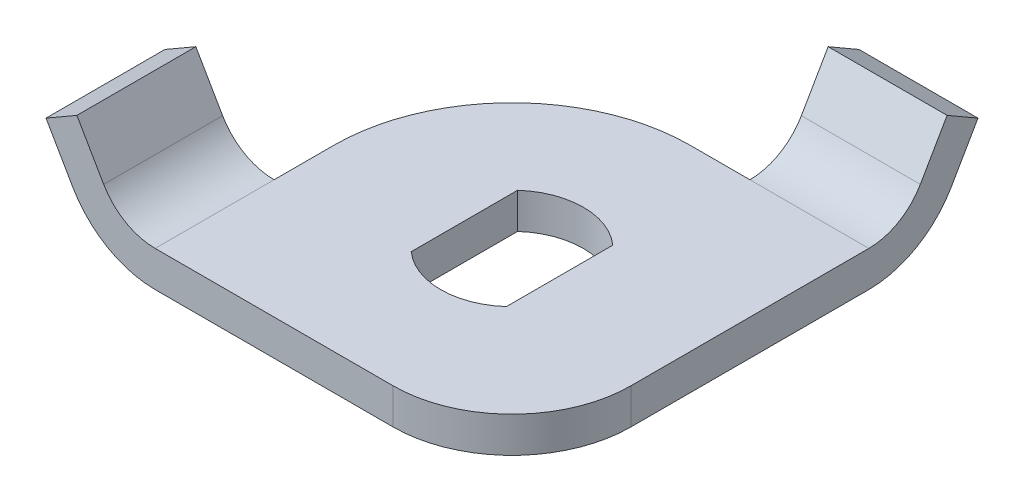
ISO-10303-21;
HEADER;
FILE_DESCRIPTION(('STEP AP214'),'2;1');
FILE_NAME('part.step','',(''),(''),'','','');
FILE_SCHEMA(('AUTOMOTIVE_DESIGN { 1 0 10303 214 1 1 1 1 }'));
ENDSEC;
DATA;
#1=APPLICATION_CONTEXT('core data for automotive mechanical design processes');
#2=APPLICATION_PROTOCOL_DEFINITION('international standard','automotive_design',2000,#1);
#3=PRODUCT_CONTEXT('',#1,'mechanical');
#4=PRODUCT('Part','Part','',(#3));
#5=PRODUCT_RELATED_PRODUCT_CATEGORY('part','',(#4));
#6=PRODUCT_DEFINITION_FORMATION('','',#4);
#7=PRODUCT_DEFINITION_CONTEXT('part definition',#1,'design');
#8=PRODUCT_DEFINITION('design','',#6,#7);
#9=PRODUCT_DEFINITION_SHAPE('','',#8);
#10=(LENGTH_UNIT() NAMED_UNIT(*) SI_UNIT(.MILLI.,.METRE.));
#11=(NAMED_UNIT(*) PLANE_ANGLE_UNIT() SI_UNIT($,.RADIAN.));
#12=(NAMED_UNIT(*) SI_UNIT($,.STERADIAN.) SOLID_ANGLE_UNIT());
#13=UNCERTAINTY_MEASURE_WITH_UNIT(LENGTH_MEASURE(1.E-05),#10,'distance_accuracy_value','');
#14=(GEOMETRIC_REPRESENTATION_CONTEXT(3) GLOBAL_UNCERTAINTY_ASSIGNED_CONTEXT((#13)) GLOBAL_UNIT_ASSIGNED_CONTEXT((#10,
#11,#12)) REPRESENTATION_CONTEXT('',''));
#15=CARTESIAN_POINT('',(0.,0.,0.));
#16=DIRECTION('',(0.,0.,1.));
#17=DIRECTION('',(1.,0.,0.));
#18=AXIS2_PLACEMENT_3D('',#15,#16,#17);
#19=CARTESIAN_POINT('',(-15.,3.,-15.));
#20=DIRECTION('',(0.,0.,1.));
#21=DIRECTION('',(1.,0.,0.));
#22=AXIS2_PLACEMENT_3D('',#19,#20,#21);
#23=PLANE('',#22);
#24=DIRECTION('',(0.,-1.,0.));
#25=VECTOR('',#24,1.);
#26=CARTESIAN_POINT('',(4.99999999999999,3.,-15.));
#27=LINE('',#26,#25);
#28=CARTESIAN_POINT('',(4.99999999999999,3.,-15.));
#29=VERTEX_POINT('',#28);
#30=CARTESIAN_POINT('',(4.99999999999999,0.,-15.));
#31=VERTEX_POINT('',#30);
#32=EDGE_CURVE('E204',#29,#31,#27,.T.);
#33=ORIENTED_EDGE('',*,*,#32,.T.);
#34=DIRECTION('',(-1.,0.,0.));
#35=VECTOR('',#34,1.);
#36=CARTESIAN_POINT('',(-15.,0.,-15.));
#37=LINE('',#36,#35);
#38=CARTESIAN_POINT('',(0.,0.,-15.));
#39=VERTEX_POINT('',#38);
#40=EDGE_CURVE('E294',#31,#39,#37,.T.);
#41=ORIENTED_EDGE('',*,*,#40,.T.);
#42=DIRECTION('',(0.,-1.,0.));
#43=VECTOR('',#42,1.);
#44=CARTESIAN_POINT('',(0.,3.,-15.));
#45=LINE('',#44,#43);
#46=CARTESIAN_POINT('',(0.,3.,-15.));
#47=VERTEX_POINT('',#46);
#48=EDGE_CURVE('E307',#39,#47,#45,.F.);
#49=ORIENTED_EDGE('',*,*,#48,.T.);
#50=DIRECTION('',(-1.,0.,0.));
#51=VECTOR('',#50,1.);
#52=CARTESIAN_POINT('',(-15.,3.,-15.));
#53=LINE('',#52,#51);
#54=EDGE_CURVE('E364',#29,#47,#53,.T.);
#55=ORIENTED_EDGE('',*,*,#54,.F.);
#56=EDGE_LOOP('',(#33,#41,#49,#55));
#57=FACE_BOUND('',#56,.T.);
#58=ADVANCED_FACE('F33',(#57),#23,.F.);
#59=CARTESIAN_POINT('',(-15.,3.,15.));
#60=DIRECTION('',(1.,0.,0.));
#61=DIRECTION('',(0.,0.,-1.));
#62=AXIS2_PLACEMENT_3D('',#59,#60,#61);
#63=PLANE('',#62);
#64=DIRECTION('',(0.,0.,1.));
#65=VECTOR('',#64,1.);
#66=CARTESIAN_POINT('',(-15.,3.,15.));
#67=LINE('',#66,#65);
#68=CARTESIAN_POINT('',(-15.,3.,0.));
#69=VERTEX_POINT('',#68);
#70=CARTESIAN_POINT('',(-15.,3.,5.));
#71=VERTEX_POINT('',#70);
#72=EDGE_CURVE('E278',#69,#71,#67,.T.);
#73=ORIENTED_EDGE('',*,*,#72,.F.);
#74=DIRECTION('',(0.,-1.,0.));
#75=VECTOR('',#74,1.);
#76=CARTESIAN_POINT('',(-15.,3.,0.));
#77=LINE('',#76,#75);
#78=CARTESIAN_POINT('',(-15.,0.,0.));
#79=VERTEX_POINT('',#78);
#80=EDGE_CURVE('E291',#69,#79,#77,.T.);
#81=ORIENTED_EDGE('',*,*,#80,.T.);
#82=DIRECTION('',(0.,0.,1.));
#83=VECTOR('',#82,1.);
#84=CARTESIAN_POINT('',(-15.,0.,15.));
#85=LINE('',#84,#83);
#86=CARTESIAN_POINT('',(-15.,0.,5.));
#87=VERTEX_POINT('',#86);
#88=EDGE_CURVE('E283',#79,#87,#85,.T.);
#89=ORIENTED_EDGE('',*,*,#88,.T.);
#90=DIRECTION('',(0.,-1.,0.));
#91=VECTOR('',#90,1.);
#92=CARTESIAN_POINT('',(-15.,0.,5.));
#93=LINE('',#92,#91);
#94=EDGE_CURVE('E252',#71,#87,#93,.T.);
#95=ORIENTED_EDGE('',*,*,#94,.F.);
#96=EDGE_LOOP('',(#73,#81,#89,#95));
#97=FACE_BOUND('',#96,.T.);
#98=ADVANCED_FACE('F407',(#97),#63,.F.);
#99=CARTESIAN_POINT('',(15.,3.,15.));
#100=DIRECTION('',(-1.,0.,0.));
#101=DIRECTION('',(0.,0.,1.));
#102=AXIS2_PLACEMENT_3D('',#99,#100,#101);
#103=PLANE('',#102);
#104=DIRECTION('',(0.,0.,-1.));
#105=VECTOR('',#104,1.);
#106=CARTESIAN_POINT('',(15.,3.,15.));
#107=LINE('',#106,#105);
#108=CARTESIAN_POINT('',(15.,3.,5.));
#109=VERTEX_POINT('',#108);
#110=CARTESIAN_POINT('',(15.,3.,-15.));
#111=VERTEX_POINT('',#110);
#112=EDGE_CURVE('E344',#109,#111,#107,.T.);
#113=ORIENTED_EDGE('',*,*,#112,.F.);
#114=DIRECTION('',(0.,-1.,0.));
#115=VECTOR('',#114,1.);
#116=CARTESIAN_POINT('',(15.,3.,5.));
#117=LINE('',#116,#115);
#118=CARTESIAN_POINT('',(15.,0.,5.));
#119=VERTEX_POINT('',#118);
#120=EDGE_CURVE('E321',#109,#119,#117,.T.);
#121=ORIENTED_EDGE('',*,*,#120,.T.);
#122=DIRECTION('',(0.,0.,-1.));
#123=VECTOR('',#122,1.);
#124=CARTESIAN_POINT('',(15.,0.,15.));
#125=LINE('',#124,#123);
#126=CARTESIAN_POINT('',(15.,0.,-15.));
#127=VERTEX_POINT('',#126);
#128=EDGE_CURVE('E292',#119,#127,#125,.T.);
#129=ORIENTED_EDGE('',*,*,#128,.T.);
#130=CARTESIAN_POINT('',(15.,8.,-15.));
#131=DIRECTION('',(1.,0.,0.));
#132=DIRECTION('',(0.,0.,-1.));
#133=AXIS2_PLACEMENT_3D('',#130,#131,#132);
#134=CIRCLE('',#133,8.);
#135=CARTESIAN_POINT('',(15.,3.99999999999997,-21.9282032302755));
#136=VERTEX_POINT('',#135);
#137=EDGE_CURVE('E223',#127,#136,#134,.T.);
#138=ORIENTED_EDGE('',*,*,#137,.T.);
#139=DIRECTION('',(0.,0.866025403784437,-0.500000000000003));
#140=VECTOR('',#139,1.);
#141=CARTESIAN_POINT('',(15.,7.89711431702993,-24.1782032302755));
#142=LINE('',#141,#140);
#143=CARTESIAN_POINT('',(15.,7.89711431702993,-24.1782032302755));
#144=VERTEX_POINT('',#143);
#145=EDGE_CURVE('E226',#136,#144,#142,.T.);
#146=ORIENTED_EDGE('',*,*,#145,.T.);
#147=DIRECTION('',(0.,0.500000000000004,0.866025403784436));
#148=VECTOR('',#147,1.);
#149=CARTESIAN_POINT('',(15.,9.39711431702994,-21.5801270189222));
#150=LINE('',#149,#148);
#151=CARTESIAN_POINT('',(15.,9.39711431702994,-21.5801270189222));
#152=VERTEX_POINT('',#151);
#153=EDGE_CURVE('E229',#144,#152,#150,.T.);
#154=ORIENTED_EDGE('',*,*,#153,.T.);
#155=DIRECTION('',(0.,-0.866025403784436,0.500000000000004));
#156=VECTOR('',#155,1.);
#157=CARTESIAN_POINT('',(15.,5.49999999999998,-19.3301270189222));
#158=LINE('',#157,#156);
#159=CARTESIAN_POINT('',(15.,5.49999999999998,-19.3301270189222));
#160=VERTEX_POINT('',#159);
#161=EDGE_CURVE('E205',#152,#160,#158,.T.);
#162=ORIENTED_EDGE('',*,*,#161,.T.);
#163=CARTESIAN_POINT('',(15.,8.,-15.));
#164=DIRECTION('',(-1.,0.,0.));
#165=DIRECTION('',(0.,0.,-1.));
#166=AXIS2_PLACEMENT_3D('',#163,#164,#165);
#167=CIRCLE('',#166,5.);
#168=EDGE_CURVE('E199',#160,#111,#167,.T.);
#169=ORIENTED_EDGE('',*,*,#168,.T.);
#170=EDGE_LOOP('',(#113,#121,#129,#138,#146,#154,#162,#169));
#171=FACE_BOUND('',#170,.T.);
#172=ADVANCED_FACE('F343',(#171),#103,.F.);
#173=CARTESIAN_POINT('',(-15.,3.,15.));
#174=DIRECTION('',(0.,0.,-1.));
#175=DIRECTION('',(-1.,0.,0.));
#176=AXIS2_PLACEMENT_3D('',#173,#174,#175);
#177=PLANE('',#176);
#178=DIRECTION('',(1.,0.,0.));
#179=VECTOR('',#178,1.);
#180=CARTESIAN_POINT('',(-15.,0.,15.));
#181=LINE('',#180,#179);
#182=CARTESIAN_POINT('',(-15.,0.,15.));
#183=VERTEX_POINT('',#182);
#184=CARTESIAN_POINT('',(4.99999999999999,0.,15.));
#185=VERTEX_POINT('',#184);
#186=EDGE_CURVE('E257',#183,#185,#181,.T.);
#187=ORIENTED_EDGE('',*,*,#186,.T.);
#188=DIRECTION('',(0.,-1.,0.));
#189=VECTOR('',#188,1.);
#190=CARTESIAN_POINT('',(4.99999999999999,3.,15.));
#191=LINE('',#190,#189);
#192=CARTESIAN_POINT('',(4.99999999999999,3.,15.));
#193=VERTEX_POINT('',#192);
#194=EDGE_CURVE('E41',#185,#193,#191,.F.);
#195=ORIENTED_EDGE('',*,*,#194,.T.);
#196=DIRECTION('',(1.,0.,0.));
#197=VECTOR('',#196,1.);
#198=CARTESIAN_POINT('',(-15.,3.,15.));
#199=LINE('',#198,#197);
#200=CARTESIAN_POINT('',(-15.,3.,15.));
#201=VERTEX_POINT('',#200);
#202=EDGE_CURVE('E281',#201,#193,#199,.T.);
#203=ORIENTED_EDGE('',*,*,#202,.F.);
#204=CARTESIAN_POINT('',(-15.,8.,15.));
#205=DIRECTION('',(0.,0.,1.));
#206=DIRECTION('',(1.,0.,0.));
#207=AXIS2_PLACEMENT_3D('',#204,#205,#206);
#208=CIRCLE('',#207,5.);
#209=CARTESIAN_POINT('',(-19.3301270189222,5.50000000000001,15.));
#210=VERTEX_POINT('',#209);
#211=EDGE_CURVE('E377',#210,#201,#208,.T.);
#212=ORIENTED_EDGE('',*,*,#211,.F.);
#213=DIRECTION('',(0.499999999999999,-0.866025403784439,0.));
#214=VECTOR('',#213,1.);
#215=CARTESIAN_POINT('',(-12.1160254037845,-6.99519052838328,15.));
#216=LINE('',#215,#214);
#217=CARTESIAN_POINT('',(-21.5801270189222,9.39711431702999,15.));
#218=VERTEX_POINT('',#217);
#219=EDGE_CURVE('E375',#218,#210,#216,.T.);
#220=ORIENTED_EDGE('',*,*,#219,.F.);
#221=DIRECTION('',(0.86602540378444,0.499999999999997,0.));
#222=VECTOR('',#221,1.);
#223=CARTESIAN_POINT('',(-9.46410161513769,16.3923048454133,15.));
#224=LINE('',#223,#222);
#225=CARTESIAN_POINT('',(-24.1782032302755,7.89711431703,15.));
#226=VERTEX_POINT('',#225);
#227=EDGE_CURVE('E246',#226,#218,#224,.T.);
#228=ORIENTED_EDGE('',*,*,#227,.F.);
#229=DIRECTION('',(0.499999999999998,-0.86602540378444,0.));
#230=VECTOR('',#229,1.);
#231=CARTESIAN_POINT('',(-14.7141016151378,-8.49519052838328,15.));
#232=LINE('',#231,#230);
#233=CARTESIAN_POINT('',(-21.9282032302755,4.00000000000002,15.));
#234=VERTEX_POINT('',#233);
#235=EDGE_CURVE('E236',#226,#234,#232,.T.);
#236=ORIENTED_EDGE('',*,*,#235,.T.);
#237=CARTESIAN_POINT('',(-15.,8.,15.));
#238=DIRECTION('',(0.,0.,1.));
#239=DIRECTION('',(1.,0.,0.));
#240=AXIS2_PLACEMENT_3D('',#237,#238,#239);
#241=CIRCLE('',#240,8.);
#242=EDGE_CURVE('E379',#234,#183,#241,.T.);
#243=ORIENTED_EDGE('',*,*,#242,.T.);
#244=EDGE_LOOP('',(#187,#195,#203,#212,#220,#228,#236,#243));
#245=FACE_BOUND('',#244,.T.);
#246=ADVANCED_FACE('F331',(#245),#177,.F.);
#247=CARTESIAN_POINT('',(0.,3.,0.));
#248=DIRECTION('',(0.,-1.,0.));
#249=DIRECTION('',(0.,0.,-1.));
#250=AXIS2_PLACEMENT_3D('',#247,#248,#249);
#251=PLANE('',#250);
#252=DIRECTION('',(0.,0.,1.));
#253=VECTOR('',#252,1.);
#254=CARTESIAN_POINT('',(-4.,3.,-4.47213595499958));
#255=LINE('',#254,#253);
#256=CARTESIAN_POINT('',(-4.,3.,-4.47213595499958));
#257=VERTEX_POINT('',#256);
#258=CARTESIAN_POINT('',(-4.,3.,4.47213595499958));
#259=VERTEX_POINT('',#258);
#260=EDGE_CURVE('E605',#257,#259,#255,.T.);
#261=ORIENTED_EDGE('',*,*,#260,.F.);
#262=CARTESIAN_POINT('',(0.,3.,0.));
#263=DIRECTION('',(0.,-1.,0.));
#264=DIRECTION('',(0.,0.,-1.));
#265=AXIS2_PLACEMENT_3D('',#262,#263,#264);
#266=CIRCLE('',#265,6.);
#267=CARTESIAN_POINT('',(4.,3.,-4.47213595499958));
#268=VERTEX_POINT('',#267);
#269=EDGE_CURVE('E200',#268,#257,#266,.F.);
#270=ORIENTED_EDGE('',*,*,#269,.F.);
#271=DIRECTION('',(0.,0.,-1.));
#272=VECTOR('',#271,1.);
#273=CARTESIAN_POINT('',(4.,3.,4.47213595499958));
#274=LINE('',#273,#272);
#275=CARTESIAN_POINT('',(4.,3.,4.47213595499958));
#276=VERTEX_POINT('',#275);
#277=EDGE_CURVE('E197',#276,#268,#274,.T.);
#278=ORIENTED_EDGE('',*,*,#277,.F.);
#279=CARTESIAN_POINT('',(0.,3.,0.));
#280=DIRECTION('',(0.,-1.,0.));
#281=DIRECTION('',(0.,0.,-1.));
#282=AXIS2_PLACEMENT_3D('',#279,#280,#281);
#283=CIRCLE('',#282,6.);
#284=EDGE_CURVE('E175',#259,#276,#283,.F.);
#285=ORIENTED_EDGE('',*,*,#284,.F.);
#286=EDGE_LOOP('',(#261,#270,#278,#285));
#287=FACE_BOUND('',#286,.T.);
#288=ORIENTED_EDGE('',*,*,#202,.T.);
#289=CARTESIAN_POINT('',(4.99999999999999,3.,5.));
#290=DIRECTION('',(0.,-1.,0.));
#291=DIRECTION('',(0.,0.,-1.));
#292=AXIS2_PLACEMENT_3D('',#289,#290,#291);
#293=CIRCLE('',#292,10.);
#294=EDGE_CURVE('E11',#193,#109,#293,.F.);
#295=ORIENTED_EDGE('',*,*,#294,.T.);
#296=ORIENTED_EDGE('',*,*,#112,.T.);
#297=EDGE_CURVE('E282',#111,#29,#53,.T.);
#298=ORIENTED_EDGE('',*,*,#297,.T.);
#299=ORIENTED_EDGE('',*,*,#54,.T.);
#300=CARTESIAN_POINT('',(0.,3.,0.));
#301=DIRECTION('',(0.,-1.,0.));
#302=DIRECTION('',(0.,0.,-1.));
#303=AXIS2_PLACEMENT_3D('',#300,#301,#302);
#304=CIRCLE('',#303,15.);
#305=EDGE_CURVE('E319',#47,#69,#304,.F.);
#306=ORIENTED_EDGE('',*,*,#305,.T.);
#307=ORIENTED_EDGE('',*,*,#72,.T.);
#308=DIRECTION('',(0.,0.,1.));
#309=VECTOR('',#308,1.);
#310=CARTESIAN_POINT('',(-15.,3.,5.));
#311=LINE('',#310,#309);
#312=EDGE_CURVE('E262',#71,#201,#311,.T.);
#313=ORIENTED_EDGE('',*,*,#312,.T.);
#314=EDGE_LOOP('',(#288,#295,#296,#298,#299,#306,#307,#313));
#315=FACE_BOUND('',#314,.T.);
#316=ADVANCED_FACE('F338',(#287,#315),#251,.F.);
#317=CARTESIAN_POINT('',(0.,0.,0.));
#318=DIRECTION('',(0.,-1.,0.));
#319=DIRECTION('',(0.,0.,-1.));
#320=AXIS2_PLACEMENT_3D('',#317,#318,#319);
#321=PLANE('',#320);
#322=CARTESIAN_POINT('',(0.,0.,0.));
#323=DIRECTION('',(0.,-1.,0.));
#324=DIRECTION('',(0.,0.,-1.));
#325=AXIS2_PLACEMENT_3D('',#322,#323,#324);
#326=CIRCLE('',#325,6.);
#327=CARTESIAN_POINT('',(-4.,0.,-4.47213595499958));
#328=VERTEX_POINT('',#327);
#329=CARTESIAN_POINT('',(4.,0.,-4.47213595499958));
#330=VERTEX_POINT('',#329);
#331=EDGE_CURVE('E56',#328,#330,#326,.T.);
#332=ORIENTED_EDGE('',*,*,#331,.F.);
#333=DIRECTION('',(0.,0.,-1.));
#334=VECTOR('',#333,1.);
#335=CARTESIAN_POINT('',(-4.,0.,-4.47213595499958));
#336=LINE('',#335,#334);
#337=CARTESIAN_POINT('',(-4.,0.,4.47213595499958));
#338=VERTEX_POINT('',#337);
#339=EDGE_CURVE('E188',#338,#328,#336,.T.);
#340=ORIENTED_EDGE('',*,*,#339,.F.);
#341=CARTESIAN_POINT('',(0.,0.,0.));
#342=DIRECTION('',(0.,-1.,0.));
#343=DIRECTION('',(0.,0.,-1.));
#344=AXIS2_PLACEMENT_3D('',#341,#342,#343);
#345=CIRCLE('',#344,6.);
#346=CARTESIAN_POINT('',(4.,0.,4.47213595499958));
#347=VERTEX_POINT('',#346);
#348=EDGE_CURVE('E172',#347,#338,#345,.T.);
#349=ORIENTED_EDGE('',*,*,#348,.F.);
#350=DIRECTION('',(0.,0.,1.));
#351=VECTOR('',#350,1.);
#352=CARTESIAN_POINT('',(4.,0.,4.47213595499958));
#353=LINE('',#352,#351);
#354=EDGE_CURVE('E181',#330,#347,#353,.T.);
#355=ORIENTED_EDGE('',*,*,#354,.F.);
#356=EDGE_LOOP('',(#332,#340,#349,#355));
#357=FACE_BOUND('',#356,.T.);
#358=ORIENTED_EDGE('',*,*,#128,.F.);
#359=CARTESIAN_POINT('',(4.99999999999999,0.,5.));
#360=DIRECTION('',(0.,-1.,0.));
#361=DIRECTION('',(0.,0.,-1.));
#362=AXIS2_PLACEMENT_3D('',#359,#360,#361);
#363=CIRCLE('',#362,10.);
#364=EDGE_CURVE('E326',#119,#185,#363,.T.);
#365=ORIENTED_EDGE('',*,*,#364,.T.);
#366=ORIENTED_EDGE('',*,*,#186,.F.);
#367=DIRECTION('',(0.,0.,1.));
#368=VECTOR('',#367,1.);
#369=CARTESIAN_POINT('',(-15.,0.,5.));
#370=LINE('',#369,#368);
#371=EDGE_CURVE('E259',#87,#183,#370,.T.);
#372=ORIENTED_EDGE('',*,*,#371,.F.);
#373=ORIENTED_EDGE('',*,*,#88,.F.);
#374=CARTESIAN_POINT('',(0.,0.,0.));
#375=DIRECTION('',(0.,-1.,0.));
#376=DIRECTION('',(0.,0.,-1.));
#377=AXIS2_PLACEMENT_3D('',#374,#375,#376);
#378=CIRCLE('',#377,15.);
#379=EDGE_CURVE('E311',#79,#39,#378,.T.);
#380=ORIENTED_EDGE('',*,*,#379,.T.);
#381=ORIENTED_EDGE('',*,*,#40,.F.);
#382=EDGE_CURVE('E296',#127,#31,#37,.T.);
#383=ORIENTED_EDGE('',*,*,#382,.F.);
#384=EDGE_LOOP('',(#358,#365,#366,#372,#373,#380,#381,#383));
#385=FACE_BOUND('',#384,.T.);
#386=ADVANCED_FACE('F185',(#357,#385),#321,.T.);
#387=CARTESIAN_POINT('',(-14.7141016151378,-8.49519052838328,5.));
#388=DIRECTION('',(-0.86602540378444,-0.499999999999998,0.));
#389=DIRECTION('',(0.499999999999998,-0.86602540378444,0.));
#390=AXIS2_PLACEMENT_3D('',#387,#388,#389);
#391=PLANE('',#390);
#392=ORIENTED_EDGE('',*,*,#235,.F.);
#393=DIRECTION('',(0.,0.,1.));
#394=VECTOR('',#393,1.);
#395=CARTESIAN_POINT('',(-24.1782032302755,7.89711431703,5.));
#396=LINE('',#395,#394);
#397=CARTESIAN_POINT('',(-24.1782032302755,7.89711431703,5.));
#398=VERTEX_POINT('',#397);
#399=EDGE_CURVE('E295',#398,#226,#396,.T.);
#400=ORIENTED_EDGE('',*,*,#399,.F.);
#401=DIRECTION('',(0.499999999999998,-0.86602540378444,0.));
#402=VECTOR('',#401,1.);
#403=CARTESIAN_POINT('',(-14.7141016151378,-8.49519052838328,5.));
#404=LINE('',#403,#402);
#405=CARTESIAN_POINT('',(-21.9282032302755,4.00000000000002,5.));
#406=VERTEX_POINT('',#405);
#407=EDGE_CURVE('E242',#398,#406,#404,.T.);
#408=ORIENTED_EDGE('',*,*,#407,.T.);
#409=DIRECTION('',(0.,0.,1.));
#410=VECTOR('',#409,1.);
#411=CARTESIAN_POINT('',(-21.9282032302755,4.00000000000002,5.));
#412=LINE('',#411,#410);
#413=EDGE_CURVE('E263',#406,#234,#412,.T.);
#414=ORIENTED_EDGE('',*,*,#413,.T.);
#415=EDGE_LOOP('',(#392,#400,#408,#414));
#416=FACE_BOUND('',#415,.T.);
#417=ADVANCED_FACE('F399',(#416),#391,.T.);
#418=CARTESIAN_POINT('',(-9.46410161513769,16.3923048454133,5.));
#419=DIRECTION('',(0.499999999999997,-0.86602540378444,0.));
#420=DIRECTION('',(0.86602540378444,0.499999999999998,0.));
#421=AXIS2_PLACEMENT_3D('',#418,#419,#420);
#422=PLANE('',#421);
#423=ORIENTED_EDGE('',*,*,#227,.T.);
#424=DIRECTION('',(0.,0.,1.));
#425=VECTOR('',#424,1.);
#426=CARTESIAN_POINT('',(-21.5801270189222,9.39711431702999,5.));
#427=LINE('',#426,#425);
#428=CARTESIAN_POINT('',(-21.5801270189222,9.39711431702999,5.));
#429=VERTEX_POINT('',#428);
#430=EDGE_CURVE('E370',#429,#218,#427,.T.);
#431=ORIENTED_EDGE('',*,*,#430,.F.);
#432=DIRECTION('',(0.86602540378444,0.499999999999997,0.));
#433=VECTOR('',#432,1.);
#434=CARTESIAN_POINT('',(-9.46410161513769,16.3923048454133,5.));
#435=LINE('',#434,#433);
#436=EDGE_CURVE('E367',#398,#429,#435,.T.);
#437=ORIENTED_EDGE('',*,*,#436,.F.);
#438=ORIENTED_EDGE('',*,*,#399,.T.);
#439=EDGE_LOOP('',(#423,#431,#437,#438));
#440=FACE_BOUND('',#439,.T.);
#441=ADVANCED_FACE('F431',(#440),#422,.F.);
#442=CARTESIAN_POINT('',(-12.1160254037845,-6.99519052838328,5.));
#443=DIRECTION('',(-0.866025403784439,-0.499999999999999,0.));
#444=DIRECTION('',(0.499999999999999,-0.866025403784439,0.));
#445=AXIS2_PLACEMENT_3D('',#442,#443,#444);
#446=PLANE('',#445);
#447=ORIENTED_EDGE('',*,*,#219,.T.);
#448=DIRECTION('',(0.,0.,1.));
#449=VECTOR('',#448,1.);
#450=CARTESIAN_POINT('',(-19.3301270189222,5.50000000000001,5.));
#451=LINE('',#450,#449);
#452=CARTESIAN_POINT('',(-19.3301270189222,5.50000000000001,5.));
#453=VERTEX_POINT('',#452);
#454=EDGE_CURVE('E275',#453,#210,#451,.T.);
#455=ORIENTED_EDGE('',*,*,#454,.F.);
#456=DIRECTION('',(0.499999999999999,-0.866025403784439,0.));
#457=VECTOR('',#456,1.);
#458=CARTESIAN_POINT('',(-12.1160254037845,-6.99519052838328,5.));
#459=LINE('',#458,#457);
#460=EDGE_CURVE('E249',#429,#453,#459,.T.);
#461=ORIENTED_EDGE('',*,*,#460,.F.);
#462=ORIENTED_EDGE('',*,*,#430,.T.);
#463=EDGE_LOOP('',(#447,#455,#461,#462));
#464=FACE_BOUND('',#463,.T.);
#465=ADVANCED_FACE('F391',(#464),#446,.F.);
#466=CARTESIAN_POINT('',(-15.,8.,5.));
#467=DIRECTION('',(0.,0.,1.));
#468=DIRECTION('',(1.,0.,0.));
#469=AXIS2_PLACEMENT_3D('',#466,#467,#468);
#470=CYLINDRICAL_SURFACE('',#469,5.);
#471=ORIENTED_EDGE('',*,*,#211,.T.);
#472=ORIENTED_EDGE('',*,*,#312,.F.);
#473=CARTESIAN_POINT('',(-15.,8.,5.));
#474=DIRECTION('',(0.,0.,1.));
#475=DIRECTION('',(1.,0.,0.));
#476=AXIS2_PLACEMENT_3D('',#473,#474,#475);
#477=CIRCLE('',#476,5.);
#478=EDGE_CURVE('E256',#453,#71,#477,.T.);
#479=ORIENTED_EDGE('',*,*,#478,.F.);
#480=ORIENTED_EDGE('',*,*,#454,.T.);
#481=EDGE_LOOP('',(#471,#472,#479,#480));
#482=FACE_BOUND('',#481,.T.);
#483=ADVANCED_FACE('F394',(#482),#470,.F.);
#484=CARTESIAN_POINT('',(-15.,8.,5.));
#485=DIRECTION('',(0.,0.,1.));
#486=DIRECTION('',(1.,0.,0.));
#487=AXIS2_PLACEMENT_3D('',#484,#485,#486);
#488=CYLINDRICAL_SURFACE('',#487,8.);
#489=ORIENTED_EDGE('',*,*,#242,.F.);
#490=ORIENTED_EDGE('',*,*,#413,.F.);
#491=CARTESIAN_POINT('',(-15.,8.,5.));
#492=DIRECTION('',(0.,0.,1.));
#493=DIRECTION('',(1.,0.,0.));
#494=AXIS2_PLACEMENT_3D('',#491,#492,#493);
#495=CIRCLE('',#494,8.);
#496=EDGE_CURVE('E245',#406,#87,#495,.T.);
#497=ORIENTED_EDGE('',*,*,#496,.T.);
#498=ORIENTED_EDGE('',*,*,#371,.T.);
#499=EDGE_LOOP('',(#489,#490,#497,#498));
#500=FACE_BOUND('',#499,.T.);
#501=ADVANCED_FACE('F403',(#500),#488,.T.);
#502=CARTESIAN_POINT('',(0.,0.,5.));
#503=DIRECTION('',(0.,0.,1.));
#504=DIRECTION('',(1.,0.,0.));
#505=AXIS2_PLACEMENT_3D('',#502,#503,#504);
#506=PLANE('',#505);
#507=ORIENTED_EDGE('',*,*,#407,.F.);
#508=ORIENTED_EDGE('',*,*,#436,.T.);
#509=ORIENTED_EDGE('',*,*,#460,.T.);
#510=ORIENTED_EDGE('',*,*,#478,.T.);
#511=ORIENTED_EDGE('',*,*,#94,.T.);
#512=ORIENTED_EDGE('',*,*,#496,.F.);
#513=EDGE_LOOP('',(#507,#508,#509,#510,#511,#512));
#514=FACE_BOUND('',#513,.T.);
#515=ADVANCED_FACE('F388',(#514),#506,.F.);
#516=CARTESIAN_POINT('',(0.,3.,0.));
#517=DIRECTION('',(0.,-1.,0.));
#518=DIRECTION('',(0.,0.,-1.));
#519=AXIS2_PLACEMENT_3D('',#516,#517,#518);
#520=CYLINDRICAL_SURFACE('',#519,15.);
#521=ORIENTED_EDGE('',*,*,#305,.F.);
#522=ORIENTED_EDGE('',*,*,#48,.F.);
#523=ORIENTED_EDGE('',*,*,#379,.F.);
#524=ORIENTED_EDGE('',*,*,#80,.F.);
#525=EDGE_LOOP('',(#521,#522,#523,#524));
#526=FACE_BOUND('',#525,.T.);
#527=ADVANCED_FACE('F318',(#526),#520,.T.);
#528=CARTESIAN_POINT('',(4.99999999999999,3.,5.));
#529=DIRECTION('',(0.,-1.,0.));
#530=DIRECTION('',(0.,0.,-1.));
#531=AXIS2_PLACEMENT_3D('',#528,#529,#530);
#532=CYLINDRICAL_SURFACE('',#531,10.);
#533=ORIENTED_EDGE('',*,*,#294,.F.);
#534=ORIENTED_EDGE('',*,*,#194,.F.);
#535=ORIENTED_EDGE('',*,*,#364,.F.);
#536=ORIENTED_EDGE('',*,*,#120,.F.);
#537=EDGE_LOOP('',(#533,#534,#535,#536));
#538=FACE_BOUND('',#537,.T.);
#539=ADVANCED_FACE('F35',(#538),#532,.T.);
#540=CARTESIAN_POINT('',(4.99999999999999,8.,-15.));
#541=DIRECTION('',(1.,0.,0.));
#542=DIRECTION('',(0.,0.,-1.));
#543=AXIS2_PLACEMENT_3D('',#540,#541,#542);
#544=CYLINDRICAL_SURFACE('',#543,5.);
#545=ORIENTED_EDGE('',*,*,#168,.F.);
#546=DIRECTION('',(1.,0.,0.));
#547=VECTOR('',#546,1.);
#548=CARTESIAN_POINT('',(4.99999999999999,5.49999999999998,-19.3301270189222));
#549=LINE('',#548,#547);
#550=CARTESIAN_POINT('',(4.99999999999999,5.49999999999998,-19.3301270189222));
#551=VERTEX_POINT('',#550);
#552=EDGE_CURVE('E234',#551,#160,#549,.T.);
#553=ORIENTED_EDGE('',*,*,#552,.F.);
#554=CARTESIAN_POINT('',(4.99999999999999,8.,-15.));
#555=DIRECTION('',(-1.,0.,0.));
#556=DIRECTION('',(0.,0.,-1.));
#557=AXIS2_PLACEMENT_3D('',#554,#555,#556);
#558=CIRCLE('',#557,5.);
#559=EDGE_CURVE('E201',#551,#29,#558,.T.);
#560=ORIENTED_EDGE('',*,*,#559,.T.);
#561=ORIENTED_EDGE('',*,*,#297,.F.);
#562=EDGE_LOOP('',(#545,#553,#560,#561));
#563=FACE_BOUND('',#562,.T.);
#564=ADVANCED_FACE('F361',(#563),#544,.F.);
#565=CARTESIAN_POINT('',(4.99999999999999,5.49999999999998,-19.3301270189222));
#566=DIRECTION('',(0.,0.500000000000004,0.866025403784437));
#567=DIRECTION('',(0.,-0.866025403784437,0.500000000000004));
#568=AXIS2_PLACEMENT_3D('',#565,#566,#567);
#569=PLANE('',#568);
#570=ORIENTED_EDGE('',*,*,#161,.F.);
#571=DIRECTION('',(1.,0.,0.));
#572=VECTOR('',#571,1.);
#573=CARTESIAN_POINT('',(4.99999999999999,9.39711431702994,-21.5801270189222));
#574=LINE('',#573,#572);
#575=CARTESIAN_POINT('',(4.99999999999999,9.39711431702994,-21.5801270189222));
#576=VERTEX_POINT('',#575);
#577=EDGE_CURVE('E237',#576,#152,#574,.T.);
#578=ORIENTED_EDGE('',*,*,#577,.F.);
#579=DIRECTION('',(0.,-0.866025403784436,0.500000000000004));
#580=VECTOR('',#579,1.);
#581=CARTESIAN_POINT('',(4.99999999999999,5.49999999999998,-19.3301270189222));
#582=LINE('',#581,#580);
#583=EDGE_CURVE('E217',#576,#551,#582,.T.);
#584=ORIENTED_EDGE('',*,*,#583,.T.);
#585=ORIENTED_EDGE('',*,*,#552,.T.);
#586=EDGE_LOOP('',(#570,#578,#584,#585));
#587=FACE_BOUND('',#586,.T.);
#588=ADVANCED_FACE('F357',(#587),#569,.T.);
#589=CARTESIAN_POINT('',(4.99999999999999,9.39711431702994,-21.5801270189222));
#590=DIRECTION('',(0.,0.866025403784436,-0.500000000000004));
#591=DIRECTION('',(0.,0.500000000000004,0.866025403784436));
#592=AXIS2_PLACEMENT_3D('',#589,#590,#591);
#593=PLANE('',#592);
#594=ORIENTED_EDGE('',*,*,#153,.F.);
#595=DIRECTION('',(1.,0.,0.));
#596=VECTOR('',#595,1.);
#597=CARTESIAN_POINT('',(4.99999999999999,7.89711431702993,-24.1782032302755));
#598=LINE('',#597,#596);
#599=CARTESIAN_POINT('',(4.99999999999999,7.89711431702993,-24.1782032302755));
#600=VERTEX_POINT('',#599);
#601=EDGE_CURVE('E239',#600,#144,#598,.T.);
#602=ORIENTED_EDGE('',*,*,#601,.F.);
#603=DIRECTION('',(0.,0.500000000000004,0.866025403784436));
#604=VECTOR('',#603,1.);
#605=CARTESIAN_POINT('',(4.99999999999999,9.39711431702994,-21.5801270189222));
#606=LINE('',#605,#604);
#607=EDGE_CURVE('E214',#600,#576,#606,.T.);
#608=ORIENTED_EDGE('',*,*,#607,.T.);
#609=ORIENTED_EDGE('',*,*,#577,.T.);
#610=EDGE_LOOP('',(#594,#602,#608,#609));
#611=FACE_BOUND('',#610,.T.);
#612=ADVANCED_FACE('F354',(#611),#593,.T.);
#613=CARTESIAN_POINT('',(4.99999999999999,7.89711431702993,-24.1782032302755));
#614=DIRECTION('',(0.,-0.500000000000003,-0.866025403784437));
#615=DIRECTION('',(0.,0.866025403784437,-0.500000000000003));
#616=AXIS2_PLACEMENT_3D('',#613,#614,#615);
#617=PLANE('',#616);
#618=ORIENTED_EDGE('',*,*,#145,.F.);
#619=DIRECTION('',(1.,0.,0.));
#620=VECTOR('',#619,1.);
#621=CARTESIAN_POINT('',(4.99999999999999,3.99999999999997,-21.9282032302755));
#622=LINE('',#621,#620);
#623=CARTESIAN_POINT('',(4.99999999999999,3.99999999999997,-21.9282032302755));
#624=VERTEX_POINT('',#623);
#625=EDGE_CURVE('E220',#624,#136,#622,.T.);
#626=ORIENTED_EDGE('',*,*,#625,.F.);
#627=DIRECTION('',(0.,0.866025403784437,-0.500000000000003));
#628=VECTOR('',#627,1.);
#629=CARTESIAN_POINT('',(4.99999999999999,7.89711431702993,-24.1782032302755));
#630=LINE('',#629,#628);
#631=EDGE_CURVE('E211',#624,#600,#630,.T.);
#632=ORIENTED_EDGE('',*,*,#631,.T.);
#633=ORIENTED_EDGE('',*,*,#601,.T.);
#634=EDGE_LOOP('',(#618,#626,#632,#633));
#635=FACE_BOUND('',#634,.T.);
#636=ADVANCED_FACE('F350',(#635),#617,.T.);
#637=CARTESIAN_POINT('',(4.99999999999999,8.,-15.));
#638=DIRECTION('',(1.,0.,0.));
#639=DIRECTION('',(0.,0.,-1.));
#640=AXIS2_PLACEMENT_3D('',#637,#638,#639);
#641=CYLINDRICAL_SURFACE('',#640,8.);
#642=ORIENTED_EDGE('',*,*,#137,.F.);
#643=ORIENTED_EDGE('',*,*,#382,.T.);
#644=CARTESIAN_POINT('',(4.99999999999999,8.,-15.));
#645=DIRECTION('',(1.,0.,0.));
#646=DIRECTION('',(0.,0.,-1.));
#647=AXIS2_PLACEMENT_3D('',#644,#645,#646);
#648=CIRCLE('',#647,8.);
#649=EDGE_CURVE('E208',#31,#624,#648,.T.);
#650=ORIENTED_EDGE('',*,*,#649,.T.);
#651=ORIENTED_EDGE('',*,*,#625,.T.);
#652=EDGE_LOOP('',(#642,#643,#650,#651));
#653=FACE_BOUND('',#652,.T.);
#654=ADVANCED_FACE('F345',(#653),#641,.T.);
#655=CARTESIAN_POINT('',(4.99999999999999,8.,-15.));
#656=DIRECTION('',(1.,0.,0.));
#657=DIRECTION('',(0.,0.,-1.));
#658=AXIS2_PLACEMENT_3D('',#655,#656,#657);
#659=PLANE('',#658);
#660=ORIENTED_EDGE('',*,*,#559,.F.);
#661=ORIENTED_EDGE('',*,*,#583,.F.);
#662=ORIENTED_EDGE('',*,*,#607,.F.);
#663=ORIENTED_EDGE('',*,*,#631,.F.);
#664=ORIENTED_EDGE('',*,*,#649,.F.);
#665=ORIENTED_EDGE('',*,*,#32,.F.);
#666=EDGE_LOOP('',(#660,#661,#662,#663,#664,#665));
#667=FACE_BOUND('',#666,.T.);
#668=ADVANCED_FACE('F547',(#667),#659,.F.);
#669=CARTESIAN_POINT('',(0.,17.422205101856,0.));
#670=DIRECTION('',(0.,-1.,0.));
#671=DIRECTION('',(0.,0.,-1.));
#672=AXIS2_PLACEMENT_3D('',#669,#670,#671);
#673=CYLINDRICAL_SURFACE('',#672,6.);
#674=ORIENTED_EDGE('',*,*,#269,.T.);
#675=DIRECTION('',(0.,-1.,0.));
#676=VECTOR('',#675,1.);
#677=CARTESIAN_POINT('',(-4.,17.422205101856,-4.47213595499958));
#678=LINE('',#677,#676);
#679=EDGE_CURVE('E193',#257,#328,#678,.T.);
#680=ORIENTED_EDGE('',*,*,#679,.T.);
#681=ORIENTED_EDGE('',*,*,#331,.T.);
#682=DIRECTION('',(0.,-1.,0.));
#683=VECTOR('',#682,1.);
#684=CARTESIAN_POINT('',(4.,17.422205101856,-4.47213595499958));
#685=LINE('',#684,#683);
#686=EDGE_CURVE('E178',#268,#330,#685,.T.);
#687=ORIENTED_EDGE('',*,*,#686,.F.);
#688=EDGE_LOOP('',(#674,#680,#681,#687));
#689=FACE_BOUND('',#688,.T.);
#690=ADVANCED_FACE('F554',(#689),#673,.F.);
#691=CARTESIAN_POINT('',(-4.,17.422205101856,-4.47213595499958));
#692=DIRECTION('',(-1.,0.,0.));
#693=DIRECTION('',(0.,0.,1.));
#694=AXIS2_PLACEMENT_3D('',#691,#692,#693);
#695=PLANE('',#694);
#696=ORIENTED_EDGE('',*,*,#260,.T.);
#697=DIRECTION('',(0.,-1.,0.));
#698=VECTOR('',#697,1.);
#699=CARTESIAN_POINT('',(-4.,17.422205101856,4.47213595499958));
#700=LINE('',#699,#698);
#701=EDGE_CURVE('E177',#259,#338,#700,.T.);
#702=ORIENTED_EDGE('',*,*,#701,.T.);
#703=ORIENTED_EDGE('',*,*,#339,.T.);
#704=ORIENTED_EDGE('',*,*,#679,.F.);
#705=EDGE_LOOP('',(#696,#702,#703,#704));
#706=FACE_BOUND('',#705,.T.);
#707=ADVANCED_FACE('F574',(#706),#695,.F.);
#708=CARTESIAN_POINT('',(0.,17.422205101856,0.));
#709=DIRECTION('',(0.,-1.,0.));
#710=DIRECTION('',(0.,0.,-1.));
#711=AXIS2_PLACEMENT_3D('',#708,#709,#710);
#712=CYLINDRICAL_SURFACE('',#711,6.);
#713=ORIENTED_EDGE('',*,*,#284,.T.);
#714=DIRECTION('',(0.,-1.,0.));
#715=VECTOR('',#714,1.);
#716=CARTESIAN_POINT('',(4.,17.422205101856,4.47213595499958));
#717=LINE('',#716,#715);
#718=EDGE_CURVE('E48',#276,#347,#717,.T.);
#719=ORIENTED_EDGE('',*,*,#718,.T.);
#720=ORIENTED_EDGE('',*,*,#348,.T.);
#721=ORIENTED_EDGE('',*,*,#701,.F.);
#722=EDGE_LOOP('',(#713,#719,#720,#721));
#723=FACE_BOUND('',#722,.T.);
#724=ADVANCED_FACE('F169',(#723),#712,.F.);
#725=CARTESIAN_POINT('',(4.,17.422205101856,4.47213595499958));
#726=DIRECTION('',(1.,0.,0.));
#727=DIRECTION('',(0.,0.,-1.));
#728=AXIS2_PLACEMENT_3D('',#725,#726,#727);
#729=PLANE('',#728);
#730=ORIENTED_EDGE('',*,*,#277,.T.);
#731=ORIENTED_EDGE('',*,*,#686,.T.);
#732=ORIENTED_EDGE('',*,*,#354,.T.);
#733=ORIENTED_EDGE('',*,*,#718,.F.);
#734=EDGE_LOOP('',(#730,#731,#732,#733));
#735=FACE_BOUND('',#734,.T.);
#736=ADVANCED_FACE('F182',(#735),#729,.F.);
#737=CLOSED_SHELL('',(#58,#98,#172,#246,#316,#386,#417,#441,#465,#483,#501,#515,#527,#539,#564,
#588,#612,#636,#654,#668,#690,#707,#724,#736));
#738=MANIFOLD_SOLID_BREP('B2',#737);
#739=ADVANCED_BREP_SHAPE_REPRESENTATION('',(#18,#738),#14);
#740=SHAPE_DEFINITION_REPRESENTATION(#9,#739);
ENDSEC;
END-ISO-10303-21;
